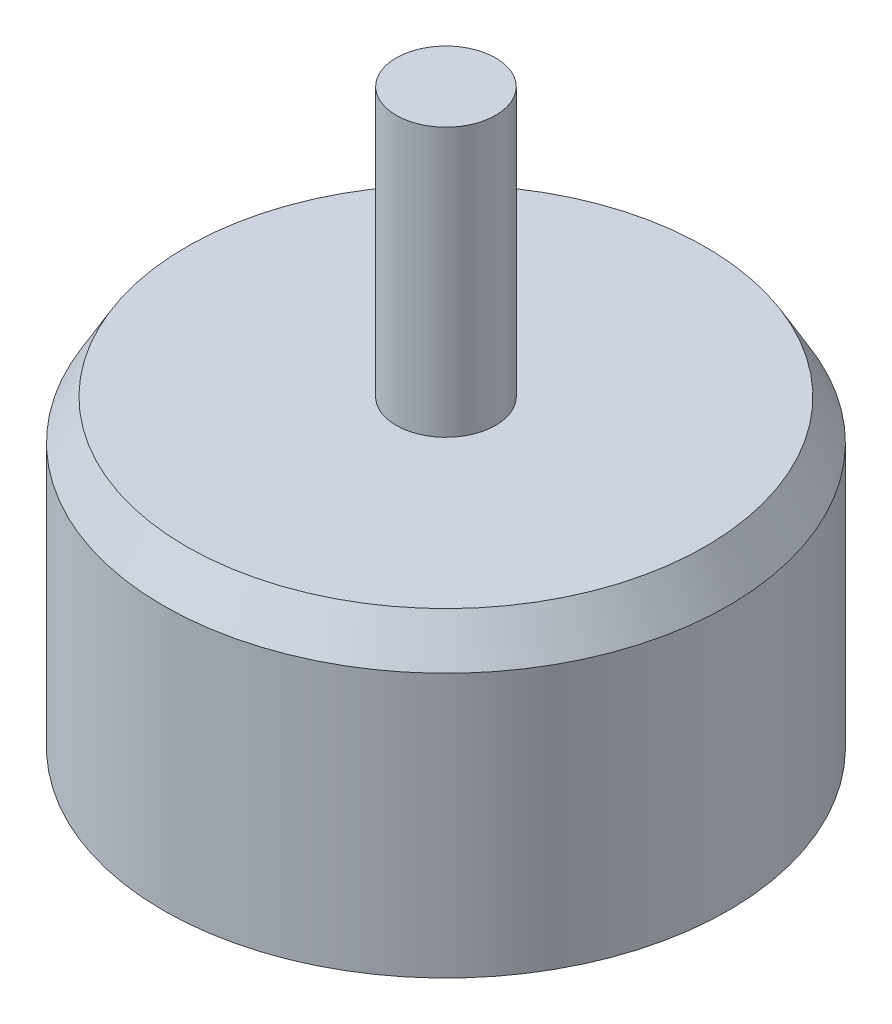
ISO-10303-21;
HEADER;
FILE_DESCRIPTION(('STEP AP214'),'2;1');
FILE_NAME('part.step','',(''),(''),'','','');
FILE_SCHEMA(('AUTOMOTIVE_DESIGN { 1 0 10303 214 1 1 1 1 }'));
ENDSEC;
DATA;
#1=APPLICATION_CONTEXT('core data for automotive mechanical design processes');
#2=APPLICATION_PROTOCOL_DEFINITION('international standard','automotive_design',2000,#1);
#3=PRODUCT_CONTEXT('',#1,'mechanical');
#4=PRODUCT('Part','Part','',(#3));
#5=PRODUCT_RELATED_PRODUCT_CATEGORY('part','',(#4));
#6=PRODUCT_DEFINITION_FORMATION('','',#4);
#7=PRODUCT_DEFINITION_CONTEXT('part definition',#1,'design');
#8=PRODUCT_DEFINITION('design','',#6,#7);
#9=PRODUCT_DEFINITION_SHAPE('','',#8);
#10=(LENGTH_UNIT() NAMED_UNIT(*) SI_UNIT(.MILLI.,.METRE.));
#11=(NAMED_UNIT(*) PLANE_ANGLE_UNIT() SI_UNIT($,.RADIAN.));
#12=(NAMED_UNIT(*) SI_UNIT($,.STERADIAN.) SOLID_ANGLE_UNIT());
#13=UNCERTAINTY_MEASURE_WITH_UNIT(LENGTH_MEASURE(1.E-05),#10,'distance_accuracy_value','');
#14=(GEOMETRIC_REPRESENTATION_CONTEXT(3) GLOBAL_UNCERTAINTY_ASSIGNED_CONTEXT((#13)) GLOBAL_UNIT_ASSIGNED_CONTEXT((#10,
#11,#12)) REPRESENTATION_CONTEXT('',''));
#15=CARTESIAN_POINT('',(0.,0.,0.));
#16=DIRECTION('',(0.,0.,1.));
#17=DIRECTION('',(1.,0.,0.));
#18=AXIS2_PLACEMENT_3D('',#15,#16,#17);
#19=CARTESIAN_POINT('',(0.,17.,0.));
#20=DIRECTION('',(0.,-1.,0.));
#21=DIRECTION('',(0.,0.,-1.));
#22=AXIS2_PLACEMENT_3D('',#19,#20,#21);
#23=CYLINDRICAL_SURFACE('',#22,14.2);
#24=CARTESIAN_POINT('',(0.,1.73205080756887,0.));
#25=DIRECTION('',(0.,1.,0.));
#26=DIRECTION('',(0.,0.,1.));
#27=AXIS2_PLACEMENT_3D('',#24,#25,#26);
#28=CIRCLE('',#27,14.2);
#29=CARTESIAN_POINT('',(0.,1.73205080756887,14.2));
#30=VERTEX_POINT('',#29);
#31=EDGE_CURVE('E100',#30,#30,#28,.T.);
#32=ORIENTED_EDGE('',*,*,#31,.T.);
#33=EDGE_LOOP('',(#32));
#34=FACE_BOUND('',#33,.T.);
#35=CARTESIAN_POINT('',(0.,15.,0.));
#36=DIRECTION('',(0.,1.,0.));
#37=DIRECTION('',(0.,0.,1.));
#38=AXIS2_PLACEMENT_3D('',#35,#36,#37);
#39=CIRCLE('',#38,14.2);
#40=CARTESIAN_POINT('',(0.,15.,14.2));
#41=VERTEX_POINT('',#40);
#42=EDGE_CURVE('E97',#41,#41,#39,.F.);
#43=ORIENTED_EDGE('',*,*,#42,.T.);
#44=EDGE_LOOP('',(#43));
#45=FACE_BOUND('',#44,.T.);
#46=ADVANCED_FACE('F32',(#34,#45),#23,.T.);
#47=CARTESIAN_POINT('',(0.,17.,0.));
#48=DIRECTION('',(0.,1.,0.));
#49=DIRECTION('',(0.,0.,1.));
#50=AXIS2_PLACEMENT_3D('',#47,#48,#49);
#51=PLANE('',#50);
#52=CARTESIAN_POINT('',(0.,17.,0.));
#53=DIRECTION('',(0.,1.,0.));
#54=DIRECTION('',(0.,0.,1.));
#55=AXIS2_PLACEMENT_3D('',#52,#53,#54);
#56=CIRCLE('',#55,13.0452994616207);
#57=CARTESIAN_POINT('',(0.,17.,13.0452994616207));
#58=VERTEX_POINT('',#57);
#59=EDGE_CURVE('E92',#58,#58,#56,.T.);
#60=ORIENTED_EDGE('',*,*,#59,.T.);
#61=EDGE_LOOP('',(#60));
#62=FACE_BOUND('',#61,.T.);
#63=CARTESIAN_POINT('',(0.,17.,0.));
#64=DIRECTION('',(0.,1.,0.));
#65=DIRECTION('',(0.,0.,1.));
#66=AXIS2_PLACEMENT_3D('',#63,#64,#65);
#67=CIRCLE('',#66,2.5);
#68=CARTESIAN_POINT('',(0.,17.,2.5));
#69=VERTEX_POINT('',#68);
#70=EDGE_CURVE('E88',#69,#69,#67,.T.);
#71=ORIENTED_EDGE('',*,*,#70,.F.);
#72=EDGE_LOOP('',(#71));
#73=FACE_BOUND('',#72,.T.);
#74=ADVANCED_FACE('F115',(#62,#73),#51,.T.);
#75=CARTESIAN_POINT('',(0.,0.,0.));
#76=DIRECTION('',(0.,1.,0.));
#77=DIRECTION('',(0.,0.,1.));
#78=AXIS2_PLACEMENT_3D('',#75,#76,#77);
#79=PLANE('',#78);
#80=CARTESIAN_POINT('',(0.,0.,0.));
#81=DIRECTION('',(0.,1.,0.));
#82=DIRECTION('',(0.,0.,1.));
#83=AXIS2_PLACEMENT_3D('',#80,#81,#82);
#84=CIRCLE('',#83,5.);
#85=CARTESIAN_POINT('',(0.,0.,5.));
#86=VERTEX_POINT('',#85);
#87=EDGE_CURVE('E11',#86,#86,#84,.F.);
#88=ORIENTED_EDGE('',*,*,#87,.F.);
#89=EDGE_LOOP('',(#88));
#90=FACE_BOUND('',#89,.T.);
#91=CARTESIAN_POINT('',(0.,0.,0.));
#92=DIRECTION('',(0.,1.,0.));
#93=DIRECTION('',(0.,0.,1.));
#94=AXIS2_PLACEMENT_3D('',#91,#92,#93);
#95=CIRCLE('',#94,11.2);
#96=CARTESIAN_POINT('',(0.,0.,11.2));
#97=VERTEX_POINT('',#96);
#98=EDGE_CURVE('E40',#97,#97,#95,.F.);
#99=ORIENTED_EDGE('',*,*,#98,.T.);
#100=EDGE_LOOP('',(#99));
#101=FACE_BOUND('',#100,.T.);
#102=CARTESIAN_POINT('',(0.,0.,8.));
#103=DIRECTION('',(0.,-1.,0.));
#104=DIRECTION('',(0.,0.,-1.));
#105=AXIS2_PLACEMENT_3D('',#102,#103,#104);
#106=CIRCLE('',#105,1.49999999999999);
#107=CARTESIAN_POINT('',(0.,0.,6.50000000000001));
#108=VERTEX_POINT('',#107);
#109=EDGE_CURVE('E64',#108,#108,#106,.T.);
#110=ORIENTED_EDGE('',*,*,#109,.F.);
#111=EDGE_LOOP('',(#110));
#112=FACE_BOUND('',#111,.T.);
#113=CARTESIAN_POINT('',(9.5,0.,0.));
#114=DIRECTION('',(0.,-1.,0.));
#115=DIRECTION('',(0.,0.,-1.));
#116=AXIS2_PLACEMENT_3D('',#113,#114,#115);
#117=CIRCLE('',#116,1.49999999999999);
#118=CARTESIAN_POINT('',(9.5,0.,-1.49999999999999));
#119=VERTEX_POINT('',#118);
#120=EDGE_CURVE('E63',#119,#119,#117,.T.);
#121=ORIENTED_EDGE('',*,*,#120,.F.);
#122=EDGE_LOOP('',(#121));
#123=FACE_BOUND('',#122,.T.);
#124=CARTESIAN_POINT('',(0.,0.,-8.));
#125=DIRECTION('',(0.,-1.,0.));
#126=DIRECTION('',(0.,0.,-1.));
#127=AXIS2_PLACEMENT_3D('',#124,#125,#126);
#128=CIRCLE('',#127,1.49999999999999);
#129=CARTESIAN_POINT('',(0.,0.,-9.49999999999999));
#130=VERTEX_POINT('',#129);
#131=EDGE_CURVE('E76',#130,#130,#128,.T.);
#132=ORIENTED_EDGE('',*,*,#131,.F.);
#133=EDGE_LOOP('',(#132));
#134=FACE_BOUND('',#133,.T.);
#135=CARTESIAN_POINT('',(-9.5,0.,0.));
#136=DIRECTION('',(0.,-1.,0.));
#137=DIRECTION('',(0.,0.,-1.));
#138=AXIS2_PLACEMENT_3D('',#135,#136,#137);
#139=CIRCLE('',#138,1.49999999999999);
#140=CARTESIAN_POINT('',(-9.5,0.,-1.49999999999999));
#141=VERTEX_POINT('',#140);
#142=EDGE_CURVE('E82',#141,#141,#139,.T.);
#143=ORIENTED_EDGE('',*,*,#142,.F.);
#144=EDGE_LOOP('',(#143));
#145=FACE_BOUND('',#144,.T.);
#146=ADVANCED_FACE('F105',(#90,#101,#112,#123,#134,#145),#79,.F.);
#147=CARTESIAN_POINT('',(0.,30.5,0.));
#148=DIRECTION('',(0.,-1.,0.));
#149=DIRECTION('',(0.,0.,-1.));
#150=AXIS2_PLACEMENT_3D('',#147,#148,#149);
#151=CYLINDRICAL_SURFACE('',#150,2.5);
#152=CARTESIAN_POINT('',(0.,30.5,0.));
#153=DIRECTION('',(0.,1.,0.));
#154=DIRECTION('',(0.,0.,1.));
#155=AXIS2_PLACEMENT_3D('',#152,#153,#154);
#156=CIRCLE('',#155,2.5);
#157=CARTESIAN_POINT('',(0.,30.5,2.5));
#158=VERTEX_POINT('',#157);
#159=EDGE_CURVE('E89',#158,#158,#156,.T.);
#160=ORIENTED_EDGE('',*,*,#159,.F.);
#161=EDGE_LOOP('',(#160));
#162=FACE_BOUND('',#161,.T.);
#163=ORIENTED_EDGE('',*,*,#70,.T.);
#164=EDGE_LOOP('',(#163));
#165=FACE_BOUND('',#164,.T.);
#166=ADVANCED_FACE('F131',(#162,#165),#151,.T.);
#167=CARTESIAN_POINT('',(0.,30.5,0.));
#168=DIRECTION('',(0.,1.,0.));
#169=DIRECTION('',(0.,0.,1.));
#170=AXIS2_PLACEMENT_3D('',#167,#168,#169);
#171=PLANE('',#170);
#172=ORIENTED_EDGE('',*,*,#159,.T.);
#173=EDGE_LOOP('',(#172));
#174=FACE_BOUND('',#173,.T.);
#175=ADVANCED_FACE('F123',(#174),#171,.T.);
#176=CARTESIAN_POINT('',(0.,17.,0.));
#177=DIRECTION('',(0.,-1.,0.));
#178=DIRECTION('',(0.,0.,-1.));
#179=AXIS2_PLACEMENT_3D('',#176,#177,#178);
#180=CONICAL_SURFACE('',#179,13.0452994616207,0.523598775598297);
#181=ORIENTED_EDGE('',*,*,#42,.F.);
#182=EDGE_LOOP('',(#181));
#183=FACE_BOUND('',#182,.T.);
#184=ORIENTED_EDGE('',*,*,#59,.F.);
#185=EDGE_LOOP('',(#184));
#186=FACE_BOUND('',#185,.T.);
#187=ADVANCED_FACE('F119',(#183,#186),#180,.T.);
#188=CARTESIAN_POINT('',(-9.5,5.,0.));
#189=DIRECTION('',(0.,-1.,0.));
#190=DIRECTION('',(0.,0.,-1.));
#191=AXIS2_PLACEMENT_3D('',#188,#189,#190);
#192=CONICAL_SURFACE('',#191,1.5,1.02974425867665);
#193=CARTESIAN_POINT('',(-9.5,5.90129092854134,0.));
#194=VERTEX_POINT('',#193);
#195=VERTEX_LOOP('',#194);
#196=FACE_BOUND('',#195,.T.);
#197=CARTESIAN_POINT('',(-9.5,5.,0.));
#198=DIRECTION('',(0.,-1.,0.));
#199=DIRECTION('',(0.,0.,-1.));
#200=AXIS2_PLACEMENT_3D('',#197,#198,#199);
#201=CIRCLE('',#200,1.5);
#202=CARTESIAN_POINT('',(-9.5,5.,-1.5));
#203=VERTEX_POINT('',#202);
#204=EDGE_CURVE('E85',#203,#203,#201,.T.);
#205=ORIENTED_EDGE('',*,*,#204,.T.);
#206=EDGE_LOOP('',(#205));
#207=FACE_BOUND('',#206,.T.);
#208=ADVANCED_FACE('F122',(#196,#207),#192,.F.);
#209=CARTESIAN_POINT('',(-9.5,0.,0.));
#210=DIRECTION('',(0.,-1.,0.));
#211=DIRECTION('',(0.,0.,-1.));
#212=AXIS2_PLACEMENT_3D('',#209,#210,#211);
#213=CYLINDRICAL_SURFACE('',#212,1.49999999999999);
#214=ORIENTED_EDGE('',*,*,#204,.F.);
#215=EDGE_LOOP('',(#214));
#216=FACE_BOUND('',#215,.T.);
#217=ORIENTED_EDGE('',*,*,#142,.T.);
#218=EDGE_LOOP('',(#217));
#219=FACE_BOUND('',#218,.T.);
#220=ADVANCED_FACE('F147',(#216,#219),#213,.F.);
#221=CARTESIAN_POINT('',(0.,5.,-8.));
#222=DIRECTION('',(0.,-1.,0.));
#223=DIRECTION('',(0.,0.,-1.));
#224=AXIS2_PLACEMENT_3D('',#221,#222,#223);
#225=CONICAL_SURFACE('',#224,1.5,1.02974425867665);
#226=CARTESIAN_POINT('',(0.,5.90129092854134,-8.));
#227=VERTEX_POINT('',#226);
#228=VERTEX_LOOP('',#227);
#229=FACE_BOUND('',#228,.T.);
#230=CARTESIAN_POINT('',(0.,5.,-8.));
#231=DIRECTION('',(0.,-1.,0.));
#232=DIRECTION('',(0.,0.,-1.));
#233=AXIS2_PLACEMENT_3D('',#230,#231,#232);
#234=CIRCLE('',#233,1.5);
#235=CARTESIAN_POINT('',(0.,5.,-9.5));
#236=VERTEX_POINT('',#235);
#237=EDGE_CURVE('E79',#236,#236,#234,.T.);
#238=ORIENTED_EDGE('',*,*,#237,.T.);
#239=EDGE_LOOP('',(#238));
#240=FACE_BOUND('',#239,.T.);
#241=ADVANCED_FACE('F150',(#229,#240),#225,.F.);
#242=CARTESIAN_POINT('',(0.,0.,-8.));
#243=DIRECTION('',(0.,-1.,0.));
#244=DIRECTION('',(0.,0.,-1.));
#245=AXIS2_PLACEMENT_3D('',#242,#243,#244);
#246=CYLINDRICAL_SURFACE('',#245,1.49999999999999);
#247=ORIENTED_EDGE('',*,*,#237,.F.);
#248=EDGE_LOOP('',(#247));
#249=FACE_BOUND('',#248,.T.);
#250=ORIENTED_EDGE('',*,*,#131,.T.);
#251=EDGE_LOOP('',(#250));
#252=FACE_BOUND('',#251,.T.);
#253=ADVANCED_FACE('F154',(#249,#252),#246,.F.);
#254=CARTESIAN_POINT('',(9.5,5.,0.));
#255=DIRECTION('',(0.,-1.,0.));
#256=DIRECTION('',(0.,0.,-1.));
#257=AXIS2_PLACEMENT_3D('',#254,#255,#256);
#258=CONICAL_SURFACE('',#257,1.5,1.02974425867665);
#259=CARTESIAN_POINT('',(9.5,5.90129092854134,0.));
#260=VERTEX_POINT('',#259);
#261=VERTEX_LOOP('',#260);
#262=FACE_BOUND('',#261,.T.);
#263=CARTESIAN_POINT('',(9.5,5.,0.));
#264=DIRECTION('',(0.,-1.,0.));
#265=DIRECTION('',(0.,0.,-1.));
#266=AXIS2_PLACEMENT_3D('',#263,#264,#265);
#267=CIRCLE('',#266,1.5);
#268=CARTESIAN_POINT('',(9.5,5.,-1.5));
#269=VERTEX_POINT('',#268);
#270=EDGE_CURVE('E67',#269,#269,#267,.T.);
#271=ORIENTED_EDGE('',*,*,#270,.T.);
#272=EDGE_LOOP('',(#271));
#273=FACE_BOUND('',#272,.T.);
#274=ADVANCED_FACE('F157',(#262,#273),#258,.F.);
#275=CARTESIAN_POINT('',(9.5,0.,0.));
#276=DIRECTION('',(0.,-1.,0.));
#277=DIRECTION('',(0.,0.,-1.));
#278=AXIS2_PLACEMENT_3D('',#275,#276,#277);
#279=CYLINDRICAL_SURFACE('',#278,1.49999999999999);
#280=ORIENTED_EDGE('',*,*,#270,.F.);
#281=EDGE_LOOP('',(#280));
#282=FACE_BOUND('',#281,.T.);
#283=ORIENTED_EDGE('',*,*,#120,.T.);
#284=EDGE_LOOP('',(#283));
#285=FACE_BOUND('',#284,.T.);
#286=ADVANCED_FACE('F57',(#282,#285),#279,.F.);
#287=CARTESIAN_POINT('',(0.,5.,8.));
#288=DIRECTION('',(0.,-1.,0.));
#289=DIRECTION('',(0.,0.,-1.));
#290=AXIS2_PLACEMENT_3D('',#287,#288,#289);
#291=CONICAL_SURFACE('',#290,1.5,1.02974425867665);
#292=CARTESIAN_POINT('',(0.,5.90129092854134,8.));
#293=VERTEX_POINT('',#292);
#294=VERTEX_LOOP('',#293);
#295=FACE_BOUND('',#294,.T.);
#296=CARTESIAN_POINT('',(0.,5.,8.));
#297=DIRECTION('',(0.,-1.,0.));
#298=DIRECTION('',(0.,0.,-1.));
#299=AXIS2_PLACEMENT_3D('',#296,#297,#298);
#300=CIRCLE('',#299,1.5);
#301=CARTESIAN_POINT('',(0.,5.,6.5));
#302=VERTEX_POINT('',#301);
#303=EDGE_CURVE('E61',#302,#302,#300,.T.);
#304=ORIENTED_EDGE('',*,*,#303,.T.);
#305=EDGE_LOOP('',(#304));
#306=FACE_BOUND('',#305,.T.);
#307=ADVANCED_FACE('F53',(#295,#306),#291,.F.);
#308=CARTESIAN_POINT('',(0.,0.,8.));
#309=DIRECTION('',(0.,-1.,0.));
#310=DIRECTION('',(0.,0.,-1.));
#311=AXIS2_PLACEMENT_3D('',#308,#309,#310);
#312=CYLINDRICAL_SURFACE('',#311,1.49999999999999);
#313=ORIENTED_EDGE('',*,*,#303,.F.);
#314=EDGE_LOOP('',(#313));
#315=FACE_BOUND('',#314,.T.);
#316=ORIENTED_EDGE('',*,*,#109,.T.);
#317=EDGE_LOOP('',(#316));
#318=FACE_BOUND('',#317,.T.);
#319=ADVANCED_FACE('F56',(#315,#318),#312,.F.);
#320=CARTESIAN_POINT('',(0.,1.73205080756887,0.));
#321=DIRECTION('',(0.,1.,0.));
#322=DIRECTION('',(0.,0.,1.));
#323=AXIS2_PLACEMENT_3D('',#320,#321,#322);
#324=CONICAL_SURFACE('',#323,14.2,1.0471975511966);
#325=ORIENTED_EDGE('',*,*,#98,.F.);
#326=EDGE_LOOP('',(#325));
#327=FACE_BOUND('',#326,.T.);
#328=ORIENTED_EDGE('',*,*,#31,.F.);
#329=EDGE_LOOP('',(#328));
#330=FACE_BOUND('',#329,.T.);
#331=ADVANCED_FACE('F34',(#327,#330),#324,.T.);
#332=CARTESIAN_POINT('',(0.,-2.,0.));
#333=DIRECTION('',(0.,1.,0.));
#334=DIRECTION('',(0.,0.,1.));
#335=AXIS2_PLACEMENT_3D('',#332,#333,#334);
#336=CYLINDRICAL_SURFACE('',#335,5.);
#337=CARTESIAN_POINT('',(0.,-2.,0.));
#338=DIRECTION('',(0.,-1.,0.));
#339=DIRECTION('',(0.,0.,-1.));
#340=AXIS2_PLACEMENT_3D('',#337,#338,#339);
#341=CIRCLE('',#340,5.);
#342=CARTESIAN_POINT('',(0.,-2.,-5.));
#343=VERTEX_POINT('',#342);
#344=EDGE_CURVE('E70',#343,#343,#341,.T.);
#345=ORIENTED_EDGE('',*,*,#344,.F.);
#346=EDGE_LOOP('',(#345));
#347=FACE_BOUND('',#346,.T.);
#348=ORIENTED_EDGE('',*,*,#87,.T.);
#349=EDGE_LOOP('',(#348));
#350=FACE_BOUND('',#349,.T.);
#351=ADVANCED_FACE('F110',(#347,#350),#336,.T.);
#352=CARTESIAN_POINT('',(0.,-2.,0.));
#353=DIRECTION('',(0.,-1.,0.));
#354=DIRECTION('',(0.,0.,-1.));
#355=AXIS2_PLACEMENT_3D('',#352,#353,#354);
#356=PLANE('',#355);
#357=ORIENTED_EDGE('',*,*,#344,.T.);
#358=EDGE_LOOP('',(#357));
#359=FACE_BOUND('',#358,.T.);
#360=ADVANCED_FACE('F169',(#359),#356,.T.);
#361=CLOSED_SHELL('',(#46,#74,#146,#166,#175,#187,#208,#220,#241,#253,#274,#286,#307,#319,#331,
#351,#360));
#362=MANIFOLD_SOLID_BREP('B2',#361);
#363=ADVANCED_BREP_SHAPE_REPRESENTATION('',(#18,#362),#14);
#364=SHAPE_DEFINITION_REPRESENTATION(#9,#363);
ENDSEC;
END-ISO-10303-21;
